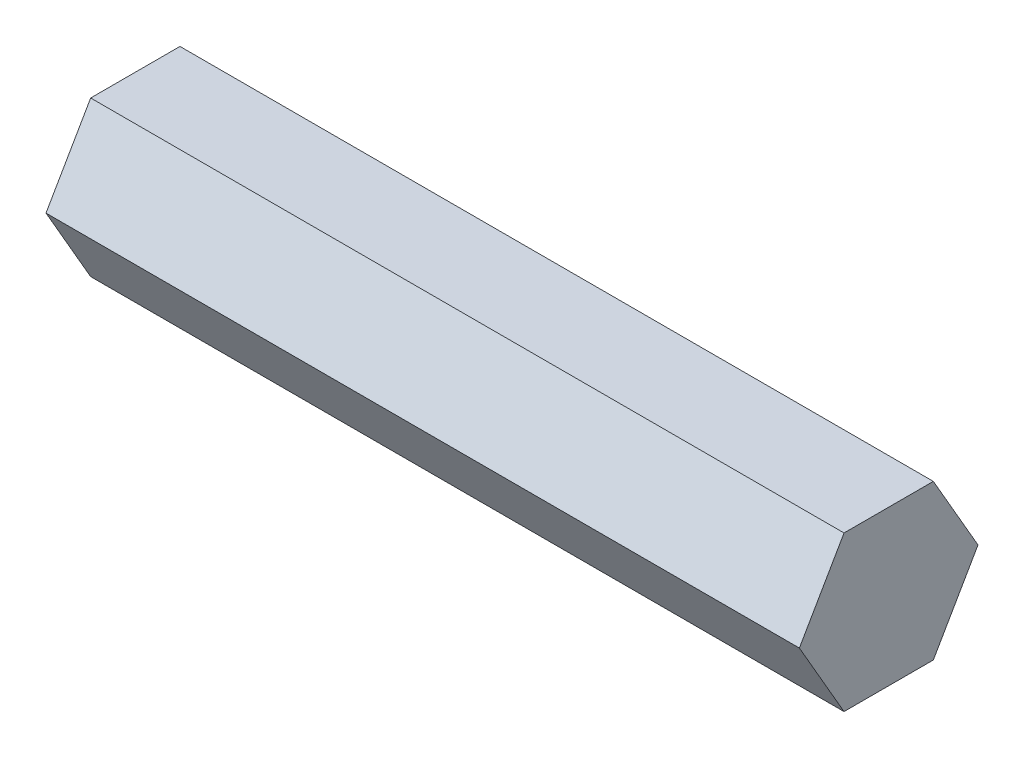
ISO-10303-21;
HEADER;
FILE_DESCRIPTION(('STEP AP214'),'2;1');
FILE_NAME('part.step','',(''),(''),'','','');
FILE_SCHEMA(('AUTOMOTIVE_DESIGN { 1 0 10303 214 1 1 1 1 }'));
ENDSEC;
DATA;
#1=APPLICATION_CONTEXT('core data for automotive mechanical design processes');
#2=APPLICATION_PROTOCOL_DEFINITION('international standard','automotive_design',2000,#1);
#3=PRODUCT_CONTEXT('',#1,'mechanical');
#4=PRODUCT('Part','Part','',(#3));
#5=PRODUCT_RELATED_PRODUCT_CATEGORY('part','',(#4));
#6=PRODUCT_DEFINITION_FORMATION('','',#4);
#7=PRODUCT_DEFINITION_CONTEXT('part definition',#1,'design');
#8=PRODUCT_DEFINITION('design','',#6,#7);
#9=PRODUCT_DEFINITION_SHAPE('','',#8);
#10=(LENGTH_UNIT() NAMED_UNIT(*) SI_UNIT(.MILLI.,.METRE.));
#11=(NAMED_UNIT(*) PLANE_ANGLE_UNIT() SI_UNIT($,.RADIAN.));
#12=(NAMED_UNIT(*) SI_UNIT($,.STERADIAN.) SOLID_ANGLE_UNIT());
#13=UNCERTAINTY_MEASURE_WITH_UNIT(LENGTH_MEASURE(1.E-05),#10,'distance_accuracy_value','');
#14=(GEOMETRIC_REPRESENTATION_CONTEXT(3) GLOBAL_UNCERTAINTY_ASSIGNED_CONTEXT((#13)) GLOBAL_UNIT_ASSIGNED_CONTEXT((#10,
#11,#12)) REPRESENTATION_CONTEXT('',''));
#15=CARTESIAN_POINT('',(0.,0.,0.));
#16=DIRECTION('',(0.,0.,1.));
#17=DIRECTION('',(1.,0.,0.));
#18=AXIS2_PLACEMENT_3D('',#15,#16,#17);
#19=CARTESIAN_POINT('',(61.85,-6.34999999999996,-3.6661742093542));
#20=DIRECTION('',(0.,0.499999999999995,0.866025403784442));
#21=DIRECTION('',(0.,-0.866025403784442,0.499999999999995));
#22=AXIS2_PLACEMENT_3D('',#19,#20,#21);
#23=PLANE('',#22);
#24=DIRECTION('',(0.,0.866025403784442,-0.499999999999995));
#25=VECTOR('',#24,1.);
#26=CARTESIAN_POINT('',(0.,-6.34999999999996,-3.6661742093542));
#27=LINE('',#26,#25);
#28=CARTESIAN_POINT('',(0.,-6.34999999999996,-3.6661742093542));
#29=VERTEX_POINT('',#28);
#30=CARTESIAN_POINT('',(0.,0.,-7.33234841870825));
#31=VERTEX_POINT('',#30);
#32=EDGE_CURVE('E125',#29,#31,#27,.T.);
#33=ORIENTED_EDGE('',*,*,#32,.T.);
#34=DIRECTION('',(-1.,0.,0.));
#35=VECTOR('',#34,1.);
#36=CARTESIAN_POINT('',(61.85,0.,-7.33234841870825));
#37=LINE('',#36,#35);
#38=CARTESIAN_POINT('',(61.85,0.,-7.33234841870825));
#39=VERTEX_POINT('',#38);
#40=EDGE_CURVE('E11',#39,#31,#37,.T.);
#41=ORIENTED_EDGE('',*,*,#40,.F.);
#42=DIRECTION('',(0.,0.866025403784442,-0.499999999999995));
#43=VECTOR('',#42,1.);
#44=CARTESIAN_POINT('',(61.85,-6.34999999999996,-3.6661742093542));
#45=LINE('',#44,#43);
#46=CARTESIAN_POINT('',(61.85,-6.34999999999996,-3.6661742093542));
#47=VERTEX_POINT('',#46);
#48=EDGE_CURVE('E132',#47,#39,#45,.T.);
#49=ORIENTED_EDGE('',*,*,#48,.F.);
#50=DIRECTION('',(-1.,0.,0.));
#51=VECTOR('',#50,1.);
#52=CARTESIAN_POINT('',(61.85,-6.34999999999996,-3.6661742093542));
#53=LINE('',#52,#51);
#54=EDGE_CURVE('E118',#47,#29,#53,.T.);
#55=ORIENTED_EDGE('',*,*,#54,.T.);
#56=EDGE_LOOP('',(#33,#41,#49,#55));
#57=FACE_BOUND('',#56,.T.);
#58=ADVANCED_FACE('F39',(#57),#23,.F.);
#59=CARTESIAN_POINT('',(61.85,0.,-7.33234841870825));
#60=DIRECTION('',(0.,-0.500000000000001,0.866025403784438));
#61=DIRECTION('',(0.,-0.866025403784438,-0.500000000000001));
#62=AXIS2_PLACEMENT_3D('',#59,#60,#61);
#63=PLANE('',#62);
#64=DIRECTION('',(0.,0.866025403784438,0.500000000000001));
#65=VECTOR('',#64,1.);
#66=CARTESIAN_POINT('',(0.,0.,-7.33234841870825));
#67=LINE('',#66,#65);
#68=CARTESIAN_POINT('',(0.,6.35000000000001,-3.66617420935411));
#69=VERTEX_POINT('',#68);
#70=EDGE_CURVE('E127',#31,#69,#67,.T.);
#71=ORIENTED_EDGE('',*,*,#70,.T.);
#72=DIRECTION('',(-1.,0.,0.));
#73=VECTOR('',#72,1.);
#74=CARTESIAN_POINT('',(61.85,6.35000000000001,-3.66617420935411));
#75=LINE('',#74,#73);
#76=CARTESIAN_POINT('',(61.85,6.35000000000001,-3.66617420935411));
#77=VERTEX_POINT('',#76);
#78=EDGE_CURVE('E50',#77,#69,#75,.T.);
#79=ORIENTED_EDGE('',*,*,#78,.F.);
#80=DIRECTION('',(0.,0.866025403784438,0.500000000000001));
#81=VECTOR('',#80,1.);
#82=CARTESIAN_POINT('',(61.85,0.,-7.33234841870825));
#83=LINE('',#82,#81);
#84=EDGE_CURVE('E95',#39,#77,#83,.T.);
#85=ORIENTED_EDGE('',*,*,#84,.F.);
#86=ORIENTED_EDGE('',*,*,#40,.T.);
#87=EDGE_LOOP('',(#71,#79,#85,#86));
#88=FACE_BOUND('',#87,.T.);
#89=ADVANCED_FACE('F160',(#88),#63,.F.);
#90=CARTESIAN_POINT('',(61.85,6.35000000000001,-3.66617420935411));
#91=DIRECTION('',(0.,-1.,0.));
#92=DIRECTION('',(0.,0.,-1.));
#93=AXIS2_PLACEMENT_3D('',#90,#91,#92);
#94=PLANE('',#93);
#95=DIRECTION('',(0.,0.,1.));
#96=VECTOR('',#95,1.);
#97=CARTESIAN_POINT('',(0.,6.35000000000001,-3.66617420935411));
#98=LINE('',#97,#96);
#99=CARTESIAN_POINT('',(0.,6.34999999999999,3.66617420935415));
#100=VERTEX_POINT('',#99);
#101=EDGE_CURVE('E126',#69,#100,#98,.T.);
#102=ORIENTED_EDGE('',*,*,#101,.T.);
#103=DIRECTION('',(-1.,0.,0.));
#104=VECTOR('',#103,1.);
#105=CARTESIAN_POINT('',(61.85,6.34999999999999,3.66617420935415));
#106=LINE('',#105,#104);
#107=CARTESIAN_POINT('',(61.85,6.34999999999999,3.66617420935415));
#108=VERTEX_POINT('',#107);
#109=EDGE_CURVE('E111',#108,#100,#106,.T.);
#110=ORIENTED_EDGE('',*,*,#109,.F.);
#111=DIRECTION('',(0.,0.,1.));
#112=VECTOR('',#111,1.);
#113=CARTESIAN_POINT('',(61.85,6.35000000000001,-3.66617420935411));
#114=LINE('',#113,#112);
#115=EDGE_CURVE('E104',#77,#108,#114,.T.);
#116=ORIENTED_EDGE('',*,*,#115,.F.);
#117=ORIENTED_EDGE('',*,*,#78,.T.);
#118=EDGE_LOOP('',(#102,#110,#116,#117));
#119=FACE_BOUND('',#118,.T.);
#120=ADVANCED_FACE('F138',(#119),#94,.F.);
#121=CARTESIAN_POINT('',(61.85,6.34999999999999,3.66617420935415));
#122=DIRECTION('',(0.,-0.499999999999995,-0.866025403784442));
#123=DIRECTION('',(0.,0.866025403784442,-0.499999999999995));
#124=AXIS2_PLACEMENT_3D('',#121,#122,#123);
#125=PLANE('',#124);
#126=DIRECTION('',(0.,-0.866025403784442,0.499999999999995));
#127=VECTOR('',#126,1.);
#128=CARTESIAN_POINT('',(0.,6.34999999999999,3.66617420935415));
#129=LINE('',#128,#127);
#130=CARTESIAN_POINT('',(0.,0.,7.33234841870825));
#131=VERTEX_POINT('',#130);
#132=EDGE_CURVE('E114',#100,#131,#129,.T.);
#133=ORIENTED_EDGE('',*,*,#132,.T.);
#134=DIRECTION('',(-1.,0.,0.));
#135=VECTOR('',#134,1.);
#136=CARTESIAN_POINT('',(61.85,0.,7.33234841870825));
#137=LINE('',#136,#135);
#138=CARTESIAN_POINT('',(61.85,0.,7.33234841870825));
#139=VERTEX_POINT('',#138);
#140=EDGE_CURVE('E109',#139,#131,#137,.T.);
#141=ORIENTED_EDGE('',*,*,#140,.F.);
#142=DIRECTION('',(0.,-0.866025403784442,0.499999999999995));
#143=VECTOR('',#142,1.);
#144=CARTESIAN_POINT('',(61.85,6.34999999999999,3.66617420935415));
#145=LINE('',#144,#143);
#146=EDGE_CURVE('E97',#108,#139,#145,.T.);
#147=ORIENTED_EDGE('',*,*,#146,.F.);
#148=ORIENTED_EDGE('',*,*,#109,.T.);
#149=EDGE_LOOP('',(#133,#141,#147,#148));
#150=FACE_BOUND('',#149,.T.);
#151=ADVANCED_FACE('F112',(#150),#125,.F.);
#152=CARTESIAN_POINT('',(61.85,0.,7.33234841870825));
#153=DIRECTION('',(0.,0.500000000000007,-0.866025403784435));
#154=DIRECTION('',(0.,0.866025403784435,0.500000000000007));
#155=AXIS2_PLACEMENT_3D('',#152,#153,#154);
#156=PLANE('',#155);
#157=DIRECTION('',(0.,-0.866025403784434,-0.500000000000007));
#158=VECTOR('',#157,1.);
#159=CARTESIAN_POINT('',(0.,0.,7.33234841870825));
#160=LINE('',#159,#158);
#161=CARTESIAN_POINT('',(0.,-6.35000000000004,3.66617420935407));
#162=VERTEX_POINT('',#161);
#163=EDGE_CURVE('E77',#131,#162,#160,.T.);
#164=ORIENTED_EDGE('',*,*,#163,.T.);
#165=DIRECTION('',(-1.,0.,0.));
#166=VECTOR('',#165,1.);
#167=CARTESIAN_POINT('',(61.85,-6.35000000000004,3.66617420935407));
#168=LINE('',#167,#166);
#169=CARTESIAN_POINT('',(61.85,-6.35000000000004,3.66617420935407));
#170=VERTEX_POINT('',#169);
#171=EDGE_CURVE('E113',#170,#162,#168,.T.);
#172=ORIENTED_EDGE('',*,*,#171,.F.);
#173=DIRECTION('',(0.,-0.866025403784434,-0.500000000000007));
#174=VECTOR('',#173,1.);
#175=CARTESIAN_POINT('',(61.85,0.,7.33234841870825));
#176=LINE('',#175,#174);
#177=EDGE_CURVE('E103',#139,#170,#176,.T.);
#178=ORIENTED_EDGE('',*,*,#177,.F.);
#179=ORIENTED_EDGE('',*,*,#140,.T.);
#180=EDGE_LOOP('',(#164,#172,#178,#179));
#181=FACE_BOUND('',#180,.T.);
#182=ADVANCED_FACE('F120',(#181),#156,.F.);
#183=CARTESIAN_POINT('',(61.85,-6.35000000000004,3.66617420935407));
#184=DIRECTION('',(0.,1.,0.));
#185=DIRECTION('',(0.,0.,1.));
#186=AXIS2_PLACEMENT_3D('',#183,#184,#185);
#187=PLANE('',#186);
#188=DIRECTION('',(0.,0.,-1.));
#189=VECTOR('',#188,1.);
#190=CARTESIAN_POINT('',(0.,-6.35000000000004,3.66617420935407));
#191=LINE('',#190,#189);
#192=EDGE_CURVE('E83',#162,#29,#191,.T.);
#193=ORIENTED_EDGE('',*,*,#192,.T.);
#194=ORIENTED_EDGE('',*,*,#54,.F.);
#195=DIRECTION('',(0.,0.,-1.));
#196=VECTOR('',#195,1.);
#197=CARTESIAN_POINT('',(61.85,-6.35000000000004,3.66617420935407));
#198=LINE('',#197,#196);
#199=EDGE_CURVE('E54',#170,#47,#198,.T.);
#200=ORIENTED_EDGE('',*,*,#199,.F.);
#201=ORIENTED_EDGE('',*,*,#171,.T.);
#202=EDGE_LOOP('',(#193,#194,#200,#201));
#203=FACE_BOUND('',#202,.T.);
#204=ADVANCED_FACE('F148',(#203),#187,.F.);
#205=CARTESIAN_POINT('',(61.85,0.,0.));
#206=DIRECTION('',(1.,0.,0.));
#207=DIRECTION('',(0.,0.,-1.));
#208=AXIS2_PLACEMENT_3D('',#205,#206,#207);
#209=PLANE('',#208);
#210=ORIENTED_EDGE('',*,*,#48,.T.);
#211=ORIENTED_EDGE('',*,*,#84,.T.);
#212=ORIENTED_EDGE('',*,*,#115,.T.);
#213=ORIENTED_EDGE('',*,*,#146,.T.);
#214=ORIENTED_EDGE('',*,*,#177,.T.);
#215=ORIENTED_EDGE('',*,*,#199,.T.);
#216=EDGE_LOOP('',(#210,#211,#212,#213,#214,#215));
#217=FACE_BOUND('',#216,.T.);
#218=ADVANCED_FACE('F101',(#217),#209,.T.);
#219=CARTESIAN_POINT('',(0.,0.,0.));
#220=DIRECTION('',(1.,0.,0.));
#221=DIRECTION('',(0.,0.,-1.));
#222=AXIS2_PLACEMENT_3D('',#219,#220,#221);
#223=PLANE('',#222);
#224=ORIENTED_EDGE('',*,*,#32,.F.);
#225=ORIENTED_EDGE('',*,*,#192,.F.);
#226=ORIENTED_EDGE('',*,*,#163,.F.);
#227=ORIENTED_EDGE('',*,*,#132,.F.);
#228=ORIENTED_EDGE('',*,*,#101,.F.);
#229=ORIENTED_EDGE('',*,*,#70,.F.);
#230=EDGE_LOOP('',(#224,#225,#226,#227,#228,#229));
#231=FACE_BOUND('',#230,.T.);
#232=ADVANCED_FACE('F142',(#231),#223,.F.);
#233=CLOSED_SHELL('',(#58,#89,#120,#151,#182,#204,#218,#232));
#234=MANIFOLD_SOLID_BREP('B2',#233);
#235=ADVANCED_BREP_SHAPE_REPRESENTATION('',(#18,#234),#14);
#236=SHAPE_DEFINITION_REPRESENTATION(#9,#235);
ENDSEC;
END-ISO-10303-21;
